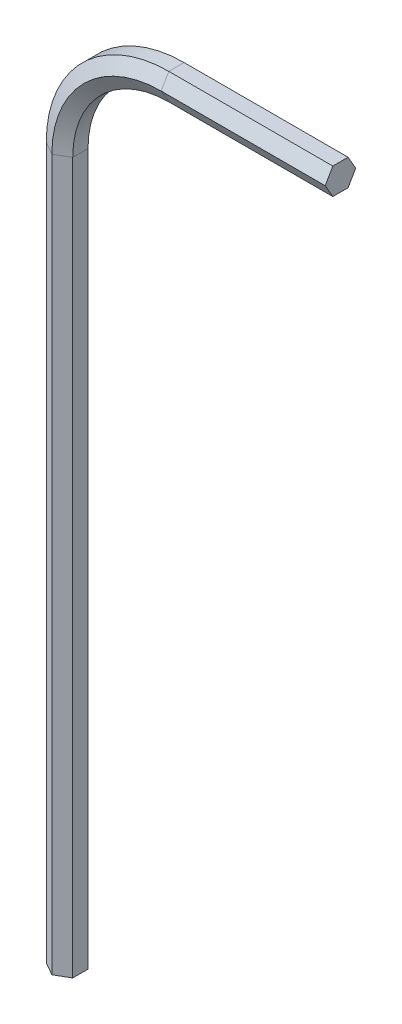
ISO-10303-21;
HEADER;
FILE_DESCRIPTION(('STEP AP214'),'2;1');
FILE_NAME('part.step','',(''),(''),'','','');
FILE_SCHEMA(('AUTOMOTIVE_DESIGN { 1 0 10303 214 1 1 1 1 }'));
ENDSEC;
DATA;
#1=APPLICATION_CONTEXT('core data for automotive mechanical design processes');
#2=APPLICATION_PROTOCOL_DEFINITION('international standard','automotive_design',2000,#1);
#3=PRODUCT_CONTEXT('',#1,'mechanical');
#4=PRODUCT('Part','Part','',(#3));
#5=PRODUCT_RELATED_PRODUCT_CATEGORY('part','',(#4));
#6=PRODUCT_DEFINITION_FORMATION('','',#4);
#7=PRODUCT_DEFINITION_CONTEXT('part definition',#1,'design');
#8=PRODUCT_DEFINITION('design','',#6,#7);
#9=PRODUCT_DEFINITION_SHAPE('','',#8);
#10=(LENGTH_UNIT() NAMED_UNIT(*) SI_UNIT(.MILLI.,.METRE.));
#11=(NAMED_UNIT(*) PLANE_ANGLE_UNIT() SI_UNIT($,.RADIAN.));
#12=(NAMED_UNIT(*) SI_UNIT($,.STERADIAN.) SOLID_ANGLE_UNIT());
#13=UNCERTAINTY_MEASURE_WITH_UNIT(LENGTH_MEASURE(1.E-05),#10,'distance_accuracy_value','');
#14=(GEOMETRIC_REPRESENTATION_CONTEXT(3) GLOBAL_UNCERTAINTY_ASSIGNED_CONTEXT((#13)) GLOBAL_UNIT_ASSIGNED_CONTEXT((#10,
#11,#12)) REPRESENTATION_CONTEXT('',''));
#15=CARTESIAN_POINT('',(0.,0.,0.));
#16=DIRECTION('',(0.,0.,1.));
#17=DIRECTION('',(1.,0.,0.));
#18=AXIS2_PLACEMENT_3D('',#15,#16,#17);
#19=CARTESIAN_POINT('',(0.,0.,0.));
#20=DIRECTION('',(0.,1.,0.));
#21=DIRECTION('',(0.,0.,1.));
#22=AXIS2_PLACEMENT_3D('',#19,#20,#21);
#23=PLANE('',#22);
#24=DIRECTION('',(-0.866025403784439,0.,-0.5));
#25=VECTOR('',#24,1.);
#26=CARTESIAN_POINT('',(0.749999999999998,0.,-0.433012701892219));
#27=LINE('',#26,#25);
#28=CARTESIAN_POINT('',(0.749999999999998,0.,-0.433012701892219));
#29=VERTEX_POINT('',#28);
#30=CARTESIAN_POINT('',(0.,0.,-0.866025403784438));
#31=VERTEX_POINT('',#30);
#32=EDGE_CURVE('E188',#29,#31,#27,.T.);
#33=ORIENTED_EDGE('',*,*,#32,.F.);
#34=DIRECTION('',(0.,0.,-1.));
#35=VECTOR('',#34,1.);
#36=CARTESIAN_POINT('',(0.749999999999998,0.,0.433012701892221));
#37=LINE('',#36,#35);
#38=CARTESIAN_POINT('',(0.749999999999998,0.,0.433012701892221));
#39=VERTEX_POINT('',#38);
#40=EDGE_CURVE('E230',#39,#29,#37,.T.);
#41=ORIENTED_EDGE('',*,*,#40,.F.);
#42=DIRECTION('',(0.866025403784439,0.,-0.5));
#43=VECTOR('',#42,1.);
#44=CARTESIAN_POINT('',(0.,0.,0.86602540378444));
#45=LINE('',#44,#43);
#46=CARTESIAN_POINT('',(0.,0.,0.86602540378444));
#47=VERTEX_POINT('',#46);
#48=EDGE_CURVE('E217',#47,#39,#45,.T.);
#49=ORIENTED_EDGE('',*,*,#48,.F.);
#50=DIRECTION('',(0.866025403784438,0.,0.5));
#51=VECTOR('',#50,1.);
#52=CARTESIAN_POINT('',(-0.750000000000001,0.,0.43301270189222));
#53=LINE('',#52,#51);
#54=CARTESIAN_POINT('',(-0.750000000000001,0.,0.43301270189222));
#55=VERTEX_POINT('',#54);
#56=EDGE_CURVE('E140',#55,#47,#53,.T.);
#57=ORIENTED_EDGE('',*,*,#56,.F.);
#58=DIRECTION('',(0.,0.,1.));
#59=VECTOR('',#58,1.);
#60=CARTESIAN_POINT('',(-0.75,0.,-0.433012701892219));
#61=LINE('',#60,#59);
#62=CARTESIAN_POINT('',(-0.75,0.,-0.433012701892219));
#63=VERTEX_POINT('',#62);
#64=EDGE_CURVE('E144',#63,#55,#61,.T.);
#65=ORIENTED_EDGE('',*,*,#64,.F.);
#66=DIRECTION('',(-0.866025403784438,0.,0.5));
#67=VECTOR('',#66,1.);
#68=CARTESIAN_POINT('',(0.,0.,-0.866025403784438));
#69=LINE('',#68,#67);
#70=EDGE_CURVE('E149',#31,#63,#69,.T.);
#71=ORIENTED_EDGE('',*,*,#70,.F.);
#72=EDGE_LOOP('',(#33,#41,#49,#57,#65,#71));
#73=FACE_BOUND('',#72,.T.);
#74=ADVANCED_FACE('F39',(#73),#23,.F.);
#75=CARTESIAN_POINT('',(15.5,46.5,0.));
#76=DIRECTION('',(1.,0.,0.));
#77=DIRECTION('',(0.,0.,1.));
#78=AXIS2_PLACEMENT_3D('',#75,#76,#77);
#79=PLANE('',#78);
#80=DIRECTION('',(0.,0.866025403784439,-0.5));
#81=VECTOR('',#80,1.);
#82=CARTESIAN_POINT('',(15.5,45.75,-0.433012701892219));
#83=LINE('',#82,#81);
#84=CARTESIAN_POINT('',(15.5,45.75,-0.433012701892219));
#85=VERTEX_POINT('',#84);
#86=CARTESIAN_POINT('',(15.5,46.5,-0.866025403784438));
#87=VERTEX_POINT('',#86);
#88=EDGE_CURVE('E160',#85,#87,#83,.T.);
#89=ORIENTED_EDGE('',*,*,#88,.T.);
#90=DIRECTION('',(0.,0.866025403784438,0.5));
#91=VECTOR('',#90,1.);
#92=CARTESIAN_POINT('',(15.5,46.5,-0.866025403784438));
#93=LINE('',#92,#91);
#94=CARTESIAN_POINT('',(15.5,47.25,-0.433012701892219));
#95=VERTEX_POINT('',#94);
#96=EDGE_CURVE('E163',#87,#95,#93,.T.);
#97=ORIENTED_EDGE('',*,*,#96,.T.);
#98=DIRECTION('',(0.,0.,1.));
#99=VECTOR('',#98,1.);
#100=CARTESIAN_POINT('',(15.5,47.25,-0.433012701892219));
#101=LINE('',#100,#99);
#102=CARTESIAN_POINT('',(15.5,47.25,0.43301270189222));
#103=VERTEX_POINT('',#102);
#104=EDGE_CURVE('E203',#95,#103,#101,.T.);
#105=ORIENTED_EDGE('',*,*,#104,.T.);
#106=DIRECTION('',(0.,-0.866025403784438,0.5));
#107=VECTOR('',#106,1.);
#108=CARTESIAN_POINT('',(15.5,47.25,0.43301270189222));
#109=LINE('',#108,#107);
#110=CARTESIAN_POINT('',(15.5,46.5,0.86602540378444));
#111=VERTEX_POINT('',#110);
#112=EDGE_CURVE('E58',#103,#111,#109,.T.);
#113=ORIENTED_EDGE('',*,*,#112,.T.);
#114=DIRECTION('',(0.,-0.866025403784439,-0.5));
#115=VECTOR('',#114,1.);
#116=CARTESIAN_POINT('',(15.5,46.5,0.86602540378444));
#117=LINE('',#116,#115);
#118=CARTESIAN_POINT('',(15.5,45.75,0.433012701892221));
#119=VERTEX_POINT('',#118);
#120=EDGE_CURVE('E52',#111,#119,#117,.T.);
#121=ORIENTED_EDGE('',*,*,#120,.T.);
#122=DIRECTION('',(0.,0.,-1.));
#123=VECTOR('',#122,1.);
#124=CARTESIAN_POINT('',(15.5,45.75,0.433012701892221));
#125=LINE('',#124,#123);
#126=EDGE_CURVE('E11',#119,#85,#125,.T.);
#127=ORIENTED_EDGE('',*,*,#126,.T.);
#128=EDGE_LOOP('',(#89,#97,#105,#113,#121,#127));
#129=FACE_BOUND('',#128,.T.);
#130=ADVANCED_FACE('F162',(#129),#79,.T.);
#131=CARTESIAN_POINT('',(0.749999999999998,0.,-0.433012701892219));
#132=DIRECTION('',(0.5,0.,-0.866025403784439));
#133=DIRECTION('',(-0.866025403784439,0.,-0.5));
#134=AXIS2_PLACEMENT_3D('',#131,#132,#133);
#135=PLANE('',#134);
#136=DIRECTION('',(0.,1.,0.));
#137=VECTOR('',#136,1.);
#138=CARTESIAN_POINT('',(0.,0.,-0.866025403784438));
#139=LINE('',#138,#137);
#140=CARTESIAN_POINT('',(0.,40.3,-0.866025403784438));
#141=VERTEX_POINT('',#140);
#142=EDGE_CURVE('E193',#31,#141,#139,.T.);
#143=ORIENTED_EDGE('',*,*,#142,.T.);
#144=DIRECTION('',(-0.866025403784439,0.,-0.5));
#145=VECTOR('',#144,1.);
#146=CARTESIAN_POINT('',(0.749999999999998,40.3,-0.433012701892219));
#147=LINE('',#146,#145);
#148=CARTESIAN_POINT('',(0.749999999999998,40.3,-0.433012701892219));
#149=VERTEX_POINT('',#148);
#150=EDGE_CURVE('E262',#149,#141,#147,.T.);
#151=ORIENTED_EDGE('',*,*,#150,.F.);
#152=DIRECTION('',(0.,1.,0.));
#153=VECTOR('',#152,1.);
#154=CARTESIAN_POINT('',(0.749999999999998,0.,-0.433012701892219));
#155=LINE('',#154,#153);
#156=EDGE_CURVE('E244',#29,#149,#155,.T.);
#157=ORIENTED_EDGE('',*,*,#156,.F.);
#158=ORIENTED_EDGE('',*,*,#32,.T.);
#159=EDGE_LOOP('',(#143,#151,#157,#158));
#160=FACE_BOUND('',#159,.T.);
#161=ADVANCED_FACE('F269',(#160),#135,.T.);
#162=CARTESIAN_POINT('',(0.,0.,-0.866025403784438));
#163=DIRECTION('',(-0.5,0.,-0.866025403784438));
#164=DIRECTION('',(-0.866025403784438,0.,0.5));
#165=AXIS2_PLACEMENT_3D('',#162,#163,#164);
#166=PLANE('',#165);
#167=DIRECTION('',(0.,1.,0.));
#168=VECTOR('',#167,1.);
#169=CARTESIAN_POINT('',(-0.75,0.,-0.433012701892219));
#170=LINE('',#169,#168);
#171=CARTESIAN_POINT('',(-0.75,40.3,-0.433012701892219));
#172=VERTEX_POINT('',#171);
#173=EDGE_CURVE('E192',#63,#172,#170,.T.);
#174=ORIENTED_EDGE('',*,*,#173,.T.);
#175=DIRECTION('',(-0.866025403784438,0.,0.5));
#176=VECTOR('',#175,1.);
#177=CARTESIAN_POINT('',(0.,40.3,-0.866025403784438));
#178=LINE('',#177,#176);
#179=EDGE_CURVE('E189',#141,#172,#178,.T.);
#180=ORIENTED_EDGE('',*,*,#179,.F.);
#181=ORIENTED_EDGE('',*,*,#142,.F.);
#182=ORIENTED_EDGE('',*,*,#70,.T.);
#183=EDGE_LOOP('',(#174,#180,#181,#182));
#184=FACE_BOUND('',#183,.T.);
#185=ADVANCED_FACE('F272',(#184),#166,.T.);
#186=CARTESIAN_POINT('',(-0.75,0.,-0.433012701892219));
#187=DIRECTION('',(-1.,0.,0.));
#188=DIRECTION('',(0.,0.,1.));
#189=AXIS2_PLACEMENT_3D('',#186,#187,#188);
#190=PLANE('',#189);
#191=DIRECTION('',(0.,1.,0.));
#192=VECTOR('',#191,1.);
#193=CARTESIAN_POINT('',(-0.750000000000001,0.,0.43301270189222));
#194=LINE('',#193,#192);
#195=CARTESIAN_POINT('',(-0.750000000000001,40.3,0.43301270189222));
#196=VERTEX_POINT('',#195);
#197=EDGE_CURVE('E206',#55,#196,#194,.T.);
#198=ORIENTED_EDGE('',*,*,#197,.T.);
#199=DIRECTION('',(0.,0.,1.));
#200=VECTOR('',#199,1.);
#201=CARTESIAN_POINT('',(-0.75,40.3,-0.433012701892219));
#202=LINE('',#201,#200);
#203=EDGE_CURVE('E196',#172,#196,#202,.T.);
#204=ORIENTED_EDGE('',*,*,#203,.F.);
#205=ORIENTED_EDGE('',*,*,#173,.F.);
#206=ORIENTED_EDGE('',*,*,#64,.T.);
#207=EDGE_LOOP('',(#198,#204,#205,#206));
#208=FACE_BOUND('',#207,.T.);
#209=ADVANCED_FACE('F329',(#208),#190,.T.);
#210=CARTESIAN_POINT('',(-0.750000000000001,0.,0.43301270189222));
#211=DIRECTION('',(-0.5,0.,0.866025403784438));
#212=DIRECTION('',(0.866025403784438,0.,0.5));
#213=AXIS2_PLACEMENT_3D('',#210,#211,#212);
#214=PLANE('',#213);
#215=DIRECTION('',(0.,1.,0.));
#216=VECTOR('',#215,1.);
#217=CARTESIAN_POINT('',(0.,0.,0.86602540378444));
#218=LINE('',#217,#216);
#219=CARTESIAN_POINT('',(0.,40.3,0.86602540378444));
#220=VERTEX_POINT('',#219);
#221=EDGE_CURVE('E219',#47,#220,#218,.T.);
#222=ORIENTED_EDGE('',*,*,#221,.T.);
#223=DIRECTION('',(0.866025403784438,0.,0.5));
#224=VECTOR('',#223,1.);
#225=CARTESIAN_POINT('',(-0.750000000000001,40.3,0.43301270189222));
#226=LINE('',#225,#224);
#227=EDGE_CURVE('E209',#196,#220,#226,.T.);
#228=ORIENTED_EDGE('',*,*,#227,.F.);
#229=ORIENTED_EDGE('',*,*,#197,.F.);
#230=ORIENTED_EDGE('',*,*,#56,.T.);
#231=EDGE_LOOP('',(#222,#228,#229,#230));
#232=FACE_BOUND('',#231,.T.);
#233=ADVANCED_FACE('F338',(#232),#214,.T.);
#234=CARTESIAN_POINT('',(0.,0.,0.86602540378444));
#235=DIRECTION('',(0.5,0.,0.866025403784439));
#236=DIRECTION('',(0.866025403784439,0.,-0.5));
#237=AXIS2_PLACEMENT_3D('',#234,#235,#236);
#238=PLANE('',#237);
#239=DIRECTION('',(0.,1.,0.));
#240=VECTOR('',#239,1.);
#241=CARTESIAN_POINT('',(0.749999999999998,0.,0.433012701892221));
#242=LINE('',#241,#240);
#243=CARTESIAN_POINT('',(0.749999999999998,40.3,0.433012701892221));
#244=VERTEX_POINT('',#243);
#245=EDGE_CURVE('E232',#39,#244,#242,.T.);
#246=ORIENTED_EDGE('',*,*,#245,.T.);
#247=DIRECTION('',(0.866025403784439,0.,-0.5));
#248=VECTOR('',#247,1.);
#249=CARTESIAN_POINT('',(0.,40.3,0.86602540378444));
#250=LINE('',#249,#248);
#251=EDGE_CURVE('E222',#220,#244,#250,.T.);
#252=ORIENTED_EDGE('',*,*,#251,.F.);
#253=ORIENTED_EDGE('',*,*,#221,.F.);
#254=ORIENTED_EDGE('',*,*,#48,.T.);
#255=EDGE_LOOP('',(#246,#252,#253,#254));
#256=FACE_BOUND('',#255,.T.);
#257=ADVANCED_FACE('F349',(#256),#238,.T.);
#258=CARTESIAN_POINT('',(0.749999999999998,0.,0.433012701892221));
#259=DIRECTION('',(1.,0.,0.));
#260=DIRECTION('',(0.,0.,-1.));
#261=AXIS2_PLACEMENT_3D('',#258,#259,#260);
#262=PLANE('',#261);
#263=DIRECTION('',(0.,0.,-1.));
#264=VECTOR('',#263,1.);
#265=CARTESIAN_POINT('',(0.749999999999998,40.3,0.433012701892221));
#266=LINE('',#265,#264);
#267=EDGE_CURVE('E235',#244,#149,#266,.T.);
#268=ORIENTED_EDGE('',*,*,#267,.F.);
#269=ORIENTED_EDGE('',*,*,#245,.F.);
#270=ORIENTED_EDGE('',*,*,#40,.T.);
#271=ORIENTED_EDGE('',*,*,#156,.T.);
#272=EDGE_LOOP('',(#268,#269,#270,#271));
#273=FACE_BOUND('',#272,.T.);
#274=ADVANCED_FACE('F285',(#273),#262,.T.);
#275=CARTESIAN_POINT('',(6.2,40.3,-0.433012701892219));
#276=DIRECTION('',(0.,0.,-1.));
#277=DIRECTION('',(-1.,0.,0.));
#278=AXIS2_PLACEMENT_3D('',#275,#276,#277);
#279=CONICAL_SURFACE('',#278,5.45,1.0471975511966);
#280=CARTESIAN_POINT('',(6.2,40.3,-0.866025403784438));
#281=DIRECTION('',(0.,0.,-1.));
#282=DIRECTION('',(-1.,0.,0.));
#283=AXIS2_PLACEMENT_3D('',#280,#281,#282);
#284=CIRCLE('',#283,6.2);
#285=CARTESIAN_POINT('',(6.2,46.5,-0.866025403784438));
#286=VERTEX_POINT('',#285);
#287=EDGE_CURVE('E199',#141,#286,#284,.T.);
#288=ORIENTED_EDGE('',*,*,#287,.T.);
#289=DIRECTION('',(0.,0.866025403784439,-0.5));
#290=VECTOR('',#289,1.);
#291=CARTESIAN_POINT('',(6.2,45.75,-0.433012701892219));
#292=LINE('',#291,#290);
#293=CARTESIAN_POINT('',(6.2,45.75,-0.433012701892219));
#294=VERTEX_POINT('',#293);
#295=EDGE_CURVE('E181',#294,#286,#292,.T.);
#296=ORIENTED_EDGE('',*,*,#295,.F.);
#297=CARTESIAN_POINT('',(6.2,40.3,-0.433012701892219));
#298=DIRECTION('',(0.,0.,-1.));
#299=DIRECTION('',(-1.,0.,0.));
#300=AXIS2_PLACEMENT_3D('',#297,#298,#299);
#301=CIRCLE('',#300,5.45);
#302=EDGE_CURVE('E246',#149,#294,#301,.T.);
#303=ORIENTED_EDGE('',*,*,#302,.F.);
#304=ORIENTED_EDGE('',*,*,#150,.T.);
#305=EDGE_LOOP('',(#288,#296,#303,#304));
#306=FACE_BOUND('',#305,.T.);
#307=ADVANCED_FACE('F252',(#306),#279,.F.);
#308=CARTESIAN_POINT('',(6.2,40.3,-0.866025403784438));
#309=DIRECTION('',(0.,0.,1.));
#310=DIRECTION('',(1.,0.,0.));
#311=AXIS2_PLACEMENT_3D('',#308,#309,#310);
#312=CONICAL_SURFACE('',#311,6.2,1.0471975511966);
#313=CARTESIAN_POINT('',(6.2,40.3,-0.433012701892219));
#314=DIRECTION('',(0.,0.,-1.));
#315=DIRECTION('',(-1.,0.,0.));
#316=AXIS2_PLACEMENT_3D('',#313,#314,#315);
#317=CIRCLE('',#316,6.95);
#318=CARTESIAN_POINT('',(6.2,47.25,-0.433012701892219));
#319=VERTEX_POINT('',#318);
#320=EDGE_CURVE('E127',#172,#319,#317,.T.);
#321=ORIENTED_EDGE('',*,*,#320,.T.);
#322=DIRECTION('',(0.,0.866025403784438,0.5));
#323=VECTOR('',#322,1.);
#324=CARTESIAN_POINT('',(6.2,46.5,-0.866025403784438));
#325=LINE('',#324,#323);
#326=EDGE_CURVE('E197',#286,#319,#325,.T.);
#327=ORIENTED_EDGE('',*,*,#326,.F.);
#328=ORIENTED_EDGE('',*,*,#287,.F.);
#329=ORIENTED_EDGE('',*,*,#179,.T.);
#330=EDGE_LOOP('',(#321,#327,#328,#329));
#331=FACE_BOUND('',#330,.T.);
#332=ADVANCED_FACE('F275',(#331),#312,.T.);
#333=CARTESIAN_POINT('',(6.2,40.3,0.));
#334=DIRECTION('',(0.,0.,-1.));
#335=DIRECTION('',(-1.,0.,0.));
#336=AXIS2_PLACEMENT_3D('',#333,#334,#335);
#337=CYLINDRICAL_SURFACE('',#336,6.95);
#338=CARTESIAN_POINT('',(6.2,40.3,0.43301270189222));
#339=DIRECTION('',(0.,0.,-1.));
#340=DIRECTION('',(-1.,0.,0.));
#341=AXIS2_PLACEMENT_3D('',#338,#339,#340);
#342=CIRCLE('',#341,6.95);
#343=CARTESIAN_POINT('',(6.2,47.25,0.43301270189222));
#344=VERTEX_POINT('',#343);
#345=EDGE_CURVE('E118',#196,#344,#342,.T.);
#346=ORIENTED_EDGE('',*,*,#345,.T.);
#347=DIRECTION('',(0.,0.,1.));
#348=VECTOR('',#347,1.);
#349=CARTESIAN_POINT('',(6.2,47.25,-0.433012701892219));
#350=LINE('',#349,#348);
#351=EDGE_CURVE('E200',#319,#344,#350,.T.);
#352=ORIENTED_EDGE('',*,*,#351,.F.);
#353=ORIENTED_EDGE('',*,*,#320,.F.);
#354=ORIENTED_EDGE('',*,*,#203,.T.);
#355=EDGE_LOOP('',(#346,#352,#353,#354));
#356=FACE_BOUND('',#355,.T.);
#357=ADVANCED_FACE('F277',(#356),#337,.T.);
#358=CARTESIAN_POINT('',(6.2,40.3,0.43301270189222));
#359=DIRECTION('',(0.,0.,-1.));
#360=DIRECTION('',(-1.,0.,0.));
#361=AXIS2_PLACEMENT_3D('',#358,#359,#360);
#362=CONICAL_SURFACE('',#361,6.95,1.0471975511966);
#363=CARTESIAN_POINT('',(6.2,40.3,0.86602540378444));
#364=DIRECTION('',(0.,0.,-1.));
#365=DIRECTION('',(-1.,0.,0.));
#366=AXIS2_PLACEMENT_3D('',#363,#364,#365);
#367=CIRCLE('',#366,6.2);
#368=CARTESIAN_POINT('',(6.2,46.5,0.86602540378444));
#369=VERTEX_POINT('',#368);
#370=EDGE_CURVE('E111',#220,#369,#367,.T.);
#371=ORIENTED_EDGE('',*,*,#370,.T.);
#372=DIRECTION('',(0.,-0.866025403784438,0.5));
#373=VECTOR('',#372,1.);
#374=CARTESIAN_POINT('',(6.2,47.25,0.43301270189222));
#375=LINE('',#374,#373);
#376=EDGE_CURVE('E213',#344,#369,#375,.T.);
#377=ORIENTED_EDGE('',*,*,#376,.F.);
#378=ORIENTED_EDGE('',*,*,#345,.F.);
#379=ORIENTED_EDGE('',*,*,#227,.T.);
#380=EDGE_LOOP('',(#371,#377,#378,#379));
#381=FACE_BOUND('',#380,.T.);
#382=ADVANCED_FACE('F283',(#381),#362,.T.);
#383=CARTESIAN_POINT('',(6.2,40.3,0.86602540378444));
#384=DIRECTION('',(0.,0.,1.));
#385=DIRECTION('',(1.,0.,0.));
#386=AXIS2_PLACEMENT_3D('',#383,#384,#385);
#387=CONICAL_SURFACE('',#386,6.2,1.0471975511966);
#388=CARTESIAN_POINT('',(6.2,40.3,0.433012701892221));
#389=DIRECTION('',(0.,0.,-1.));
#390=DIRECTION('',(-1.,0.,0.));
#391=AXIS2_PLACEMENT_3D('',#388,#389,#390);
#392=CIRCLE('',#391,5.45);
#393=CARTESIAN_POINT('',(6.2,45.75,0.433012701892221));
#394=VERTEX_POINT('',#393);
#395=EDGE_CURVE('E237',#244,#394,#392,.T.);
#396=ORIENTED_EDGE('',*,*,#395,.T.);
#397=DIRECTION('',(0.,-0.866025403784439,-0.5));
#398=VECTOR('',#397,1.);
#399=CARTESIAN_POINT('',(6.2,46.5,0.86602540378444));
#400=LINE('',#399,#398);
#401=EDGE_CURVE('E225',#369,#394,#400,.T.);
#402=ORIENTED_EDGE('',*,*,#401,.F.);
#403=ORIENTED_EDGE('',*,*,#370,.F.);
#404=ORIENTED_EDGE('',*,*,#251,.T.);
#405=EDGE_LOOP('',(#396,#402,#403,#404));
#406=FACE_BOUND('',#405,.T.);
#407=ADVANCED_FACE('F398',(#406),#387,.F.);
#408=CARTESIAN_POINT('',(6.2,40.3,0.));
#409=DIRECTION('',(0.,0.,-1.));
#410=DIRECTION('',(-1.,0.,0.));
#411=AXIS2_PLACEMENT_3D('',#408,#409,#410);
#412=CYLINDRICAL_SURFACE('',#411,5.45);
#413=DIRECTION('',(0.,0.,-1.));
#414=VECTOR('',#413,1.);
#415=CARTESIAN_POINT('',(6.2,45.75,0.433012701892221));
#416=LINE('',#415,#414);
#417=EDGE_CURVE('E186',#394,#294,#416,.T.);
#418=ORIENTED_EDGE('',*,*,#417,.F.);
#419=ORIENTED_EDGE('',*,*,#395,.F.);
#420=ORIENTED_EDGE('',*,*,#267,.T.);
#421=ORIENTED_EDGE('',*,*,#302,.T.);
#422=EDGE_LOOP('',(#418,#419,#420,#421));
#423=FACE_BOUND('',#422,.T.);
#424=ADVANCED_FACE('F255',(#423),#412,.F.);
#425=CARTESIAN_POINT('',(6.2,45.75,-0.433012701892219));
#426=DIRECTION('',(0.,-0.5,-0.866025403784439));
#427=DIRECTION('',(0.,0.866025403784439,-0.5));
#428=AXIS2_PLACEMENT_3D('',#425,#426,#427);
#429=PLANE('',#428);
#430=DIRECTION('',(1.,0.,0.));
#431=VECTOR('',#430,1.);
#432=CARTESIAN_POINT('',(6.2,46.5,-0.866025403784438));
#433=LINE('',#432,#431);
#434=EDGE_CURVE('E168',#286,#87,#433,.T.);
#435=ORIENTED_EDGE('',*,*,#434,.T.);
#436=ORIENTED_EDGE('',*,*,#88,.F.);
#437=DIRECTION('',(1.,0.,0.));
#438=VECTOR('',#437,1.);
#439=CARTESIAN_POINT('',(6.2,45.75,-0.433012701892219));
#440=LINE('',#439,#438);
#441=EDGE_CURVE('E169',#294,#85,#440,.T.);
#442=ORIENTED_EDGE('',*,*,#441,.F.);
#443=ORIENTED_EDGE('',*,*,#295,.T.);
#444=EDGE_LOOP('',(#435,#436,#442,#443));
#445=FACE_BOUND('',#444,.T.);
#446=ADVANCED_FACE('F179',(#445),#429,.T.);
#447=CARTESIAN_POINT('',(6.2,46.5,-0.866025403784438));
#448=DIRECTION('',(0.,0.5,-0.866025403784439));
#449=DIRECTION('',(0.,0.866025403784439,0.5));
#450=AXIS2_PLACEMENT_3D('',#447,#448,#449);
#451=PLANE('',#450);
#452=DIRECTION('',(1.,0.,0.));
#453=VECTOR('',#452,1.);
#454=CARTESIAN_POINT('',(6.2,47.25,-0.433012701892219));
#455=LINE('',#454,#453);
#456=EDGE_CURVE('E176',#319,#95,#455,.T.);
#457=ORIENTED_EDGE('',*,*,#456,.T.);
#458=ORIENTED_EDGE('',*,*,#96,.F.);
#459=ORIENTED_EDGE('',*,*,#434,.F.);
#460=ORIENTED_EDGE('',*,*,#326,.T.);
#461=EDGE_LOOP('',(#457,#458,#459,#460));
#462=FACE_BOUND('',#461,.T.);
#463=ADVANCED_FACE('F173',(#462),#451,.T.);
#464=CARTESIAN_POINT('',(6.2,47.25,-0.433012701892219));
#465=DIRECTION('',(0.,1.,0.));
#466=DIRECTION('',(-1.,0.,0.));
#467=AXIS2_PLACEMENT_3D('',#464,#465,#466);
#468=PLANE('',#467);
#469=DIRECTION('',(1.,0.,0.));
#470=VECTOR('',#469,1.);
#471=CARTESIAN_POINT('',(6.2,47.25,0.43301270189222));
#472=LINE('',#471,#470);
#473=EDGE_CURVE('E96',#344,#103,#472,.T.);
#474=ORIENTED_EDGE('',*,*,#473,.T.);
#475=ORIENTED_EDGE('',*,*,#104,.F.);
#476=ORIENTED_EDGE('',*,*,#456,.F.);
#477=ORIENTED_EDGE('',*,*,#351,.T.);
#478=EDGE_LOOP('',(#474,#475,#476,#477));
#479=FACE_BOUND('',#478,.T.);
#480=ADVANCED_FACE('F434',(#479),#468,.T.);
#481=CARTESIAN_POINT('',(6.2,47.25,0.43301270189222));
#482=DIRECTION('',(0.,0.5,0.866025403784438));
#483=DIRECTION('',(0.,-0.866025403784438,0.5));
#484=AXIS2_PLACEMENT_3D('',#481,#482,#483);
#485=PLANE('',#484);
#486=DIRECTION('',(1.,0.,0.));
#487=VECTOR('',#486,1.);
#488=CARTESIAN_POINT('',(6.2,46.5,0.86602540378444));
#489=LINE('',#488,#487);
#490=EDGE_CURVE('E88',#369,#111,#489,.T.);
#491=ORIENTED_EDGE('',*,*,#490,.T.);
#492=ORIENTED_EDGE('',*,*,#112,.F.);
#493=ORIENTED_EDGE('',*,*,#473,.F.);
#494=ORIENTED_EDGE('',*,*,#376,.T.);
#495=EDGE_LOOP('',(#491,#492,#493,#494));
#496=FACE_BOUND('',#495,.T.);
#497=ADVANCED_FACE('F295',(#496),#485,.T.);
#498=CARTESIAN_POINT('',(6.2,46.5,0.86602540378444));
#499=DIRECTION('',(0.,-0.5,0.866025403784439));
#500=DIRECTION('',(0.,-0.866025403784439,-0.5));
#501=AXIS2_PLACEMENT_3D('',#498,#499,#500);
#502=PLANE('',#501);
#503=DIRECTION('',(1.,0.,0.));
#504=VECTOR('',#503,1.);
#505=CARTESIAN_POINT('',(6.2,45.75,0.433012701892221));
#506=LINE('',#505,#504);
#507=EDGE_CURVE('E46',#394,#119,#506,.T.);
#508=ORIENTED_EDGE('',*,*,#507,.T.);
#509=ORIENTED_EDGE('',*,*,#120,.F.);
#510=ORIENTED_EDGE('',*,*,#490,.F.);
#511=ORIENTED_EDGE('',*,*,#401,.T.);
#512=EDGE_LOOP('',(#508,#509,#510,#511));
#513=FACE_BOUND('',#512,.T.);
#514=ADVANCED_FACE('F290',(#513),#502,.T.);
#515=CARTESIAN_POINT('',(6.2,45.75,0.433012701892221));
#516=DIRECTION('',(0.,-1.,0.));
#517=DIRECTION('',(1.,0.,0.));
#518=AXIS2_PLACEMENT_3D('',#515,#516,#517);
#519=PLANE('',#518);
#520=ORIENTED_EDGE('',*,*,#126,.F.);
#521=ORIENTED_EDGE('',*,*,#507,.F.);
#522=ORIENTED_EDGE('',*,*,#417,.T.);
#523=ORIENTED_EDGE('',*,*,#441,.T.);
#524=EDGE_LOOP('',(#520,#521,#522,#523));
#525=FACE_BOUND('',#524,.T.);
#526=ADVANCED_FACE('F247',(#525),#519,.T.);
#527=CLOSED_SHELL('',(#74,#130,#161,#185,#209,#233,#257,#274,#307,#332,#357,#382,#407,#424,#446,
#463,#480,#497,#514,#526));
#528=MANIFOLD_SOLID_BREP('B2',#527);
#529=ADVANCED_BREP_SHAPE_REPRESENTATION('',(#18,#528),#14);
#530=SHAPE_DEFINITION_REPRESENTATION(#9,#529);
ENDSEC;
END-ISO-10303-21;
